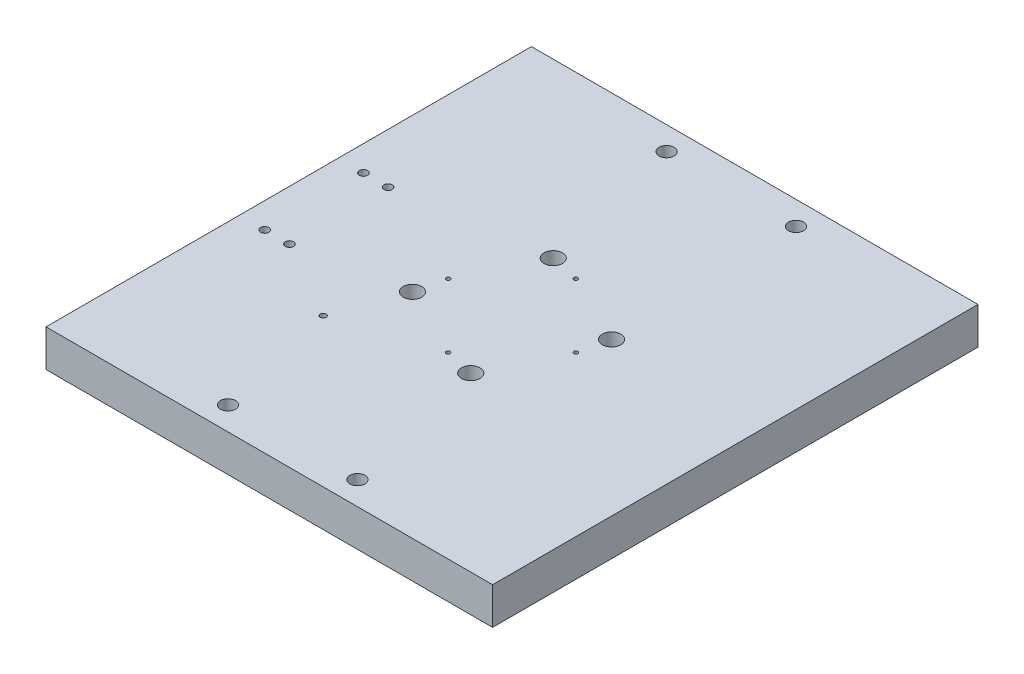
ISO-10303-21;
HEADER;
FILE_DESCRIPTION(('STEP AP214'),'2;1');
FILE_NAME('part.step','',(''),(''),'','','');
FILE_SCHEMA(('AUTOMOTIVE_DESIGN { 1 0 10303 214 1 1 1 1 }'));
ENDSEC;
DATA;
#1=APPLICATION_CONTEXT('core data for automotive mechanical design processes');
#2=APPLICATION_PROTOCOL_DEFINITION('international standard','automotive_design',2000,#1);
#3=PRODUCT_CONTEXT('',#1,'mechanical');
#4=PRODUCT('Part','Part','',(#3));
#5=PRODUCT_RELATED_PRODUCT_CATEGORY('part','',(#4));
#6=PRODUCT_DEFINITION_FORMATION('','',#4);
#7=PRODUCT_DEFINITION_CONTEXT('part definition',#1,'design');
#8=PRODUCT_DEFINITION('design','',#6,#7);
#9=PRODUCT_DEFINITION_SHAPE('','',#8);
#10=(LENGTH_UNIT() NAMED_UNIT(*) SI_UNIT(.MILLI.,.METRE.));
#11=(NAMED_UNIT(*) PLANE_ANGLE_UNIT() SI_UNIT($,.RADIAN.));
#12=(NAMED_UNIT(*) SI_UNIT($,.STERADIAN.) SOLID_ANGLE_UNIT());
#13=UNCERTAINTY_MEASURE_WITH_UNIT(LENGTH_MEASURE(1.E-05),#10,'distance_accuracy_value','');
#14=(GEOMETRIC_REPRESENTATION_CONTEXT(3) GLOBAL_UNCERTAINTY_ASSIGNED_CONTEXT((#13)) GLOBAL_UNIT_ASSIGNED_CONTEXT((#10,
#11,#12)) REPRESENTATION_CONTEXT('',''));
#15=CARTESIAN_POINT('',(0.,0.,0.));
#16=DIRECTION('',(0.,0.,1.));
#17=DIRECTION('',(1.,0.,0.));
#18=AXIS2_PLACEMENT_3D('',#15,#16,#17);
#19=CARTESIAN_POINT('',(72.511608988681,0.,-30.0352918726062));
#20=DIRECTION('',(0.,-1.,0.));
#21=DIRECTION('',(0.,0.,-1.));
#22=AXIS2_PLACEMENT_3D('',#19,#20,#21);
#23=CYLINDRICAL_SURFACE('',#22,9.52499999999999);
#24=CARTESIAN_POINT('',(72.511608988681,38.1,-30.0352918726062));
#25=DIRECTION('',(0.,-1.,0.));
#26=DIRECTION('',(0.,0.,-1.));
#27=AXIS2_PLACEMENT_3D('',#24,#25,#26);
#28=CIRCLE('',#27,9.52499999999999);
#29=CARTESIAN_POINT('',(72.511608988681,38.1,-39.5602918726062));
#30=VERTEX_POINT('',#29);
#31=EDGE_CURVE('E187',#30,#30,#28,.T.);
#32=ORIENTED_EDGE('',*,*,#31,.F.);
#33=EDGE_LOOP('',(#32));
#34=FACE_BOUND('',#33,.T.);
#35=CARTESIAN_POINT('',(72.511608988681,15.,-30.0352918726062));
#36=DIRECTION('',(0.,-1.,0.));
#37=DIRECTION('',(0.,0.,-1.));
#38=AXIS2_PLACEMENT_3D('',#35,#36,#37);
#39=CIRCLE('',#38,9.52499999999999);
#40=CARTESIAN_POINT('',(72.511608988681,15.,-39.5602918726062));
#41=VERTEX_POINT('',#40);
#42=EDGE_CURVE('E175',#41,#41,#39,.F.);
#43=ORIENTED_EDGE('',*,*,#42,.F.);
#44=EDGE_LOOP('',(#43));
#45=FACE_BOUND('',#44,.T.);
#46=ADVANCED_FACE('F35',(#34,#45),#23,.F.);
#47=CARTESIAN_POINT('',(-30.0352918726065,0.,-72.5116089886808));
#48=DIRECTION('',(0.,-1.,0.));
#49=DIRECTION('',(0.,0.,-1.));
#50=AXIS2_PLACEMENT_3D('',#47,#48,#49);
#51=CYLINDRICAL_SURFACE('',#50,9.52499999999999);
#52=CARTESIAN_POINT('',(-30.0352918726065,38.1,-72.5116089886808));
#53=DIRECTION('',(0.,-1.,0.));
#54=DIRECTION('',(0.,0.,-1.));
#55=AXIS2_PLACEMENT_3D('',#52,#53,#54);
#56=CIRCLE('',#55,9.52499999999999);
#57=CARTESIAN_POINT('',(-30.0352918726065,38.1,-82.0366089886808));
#58=VERTEX_POINT('',#57);
#59=EDGE_CURVE('E184',#58,#58,#56,.T.);
#60=ORIENTED_EDGE('',*,*,#59,.F.);
#61=EDGE_LOOP('',(#60));
#62=FACE_BOUND('',#61,.T.);
#63=CARTESIAN_POINT('',(-30.0352918726065,15.,-72.5116089886808));
#64=DIRECTION('',(0.,-1.,0.));
#65=DIRECTION('',(0.,0.,-1.));
#66=AXIS2_PLACEMENT_3D('',#63,#64,#65);
#67=CIRCLE('',#66,9.52499999999999);
#68=CARTESIAN_POINT('',(-30.0352918726065,15.,-82.0366089886808));
#69=VERTEX_POINT('',#68);
#70=EDGE_CURVE('E172',#69,#69,#67,.F.);
#71=ORIENTED_EDGE('',*,*,#70,.F.);
#72=EDGE_LOOP('',(#71));
#73=FACE_BOUND('',#72,.T.);
#74=ADVANCED_FACE('F253',(#62,#73),#51,.F.);
#75=CARTESIAN_POINT('',(30.0352918726065,0.,72.5116089886808));
#76=DIRECTION('',(0.,-1.,0.));
#77=DIRECTION('',(0.,0.,-1.));
#78=AXIS2_PLACEMENT_3D('',#75,#76,#77);
#79=CYLINDRICAL_SURFACE('',#78,9.52499999999999);
#80=CARTESIAN_POINT('',(30.0352918726065,38.1,72.5116089886808));
#81=DIRECTION('',(0.,-1.,0.));
#82=DIRECTION('',(0.,0.,-1.));
#83=AXIS2_PLACEMENT_3D('',#80,#81,#82);
#84=CIRCLE('',#83,9.52499999999999);
#85=CARTESIAN_POINT('',(30.0352918726065,38.1,62.9866089886808));
#86=VERTEX_POINT('',#85);
#87=EDGE_CURVE('E181',#86,#86,#84,.T.);
#88=ORIENTED_EDGE('',*,*,#87,.F.);
#89=EDGE_LOOP('',(#88));
#90=FACE_BOUND('',#89,.T.);
#91=CARTESIAN_POINT('',(30.0352918726065,15.,72.5116089886808));
#92=DIRECTION('',(0.,-1.,0.));
#93=DIRECTION('',(0.,0.,-1.));
#94=AXIS2_PLACEMENT_3D('',#91,#92,#93);
#95=CIRCLE('',#94,9.52499999999999);
#96=CARTESIAN_POINT('',(30.0352918726065,15.,62.9866089886808));
#97=VERTEX_POINT('',#96);
#98=EDGE_CURVE('E169',#97,#97,#95,.F.);
#99=ORIENTED_EDGE('',*,*,#98,.F.);
#100=EDGE_LOOP('',(#99));
#101=FACE_BOUND('',#100,.T.);
#102=ADVANCED_FACE('F259',(#90,#101),#79,.F.);
#103=CARTESIAN_POINT('',(-72.511608988681,0.,30.0352918726062));
#104=DIRECTION('',(0.,-1.,0.));
#105=DIRECTION('',(0.,0.,-1.));
#106=AXIS2_PLACEMENT_3D('',#103,#104,#105);
#107=CYLINDRICAL_SURFACE('',#106,9.52499999999999);
#108=CARTESIAN_POINT('',(-72.511608988681,38.1,30.0352918726062));
#109=DIRECTION('',(0.,-1.,0.));
#110=DIRECTION('',(0.,0.,-1.));
#111=AXIS2_PLACEMENT_3D('',#108,#109,#110);
#112=CIRCLE('',#111,9.52499999999999);
#113=CARTESIAN_POINT('',(-72.511608988681,38.1,20.5102918726062));
#114=VERTEX_POINT('',#113);
#115=EDGE_CURVE('E178',#114,#114,#112,.T.);
#116=ORIENTED_EDGE('',*,*,#115,.F.);
#117=EDGE_LOOP('',(#116));
#118=FACE_BOUND('',#117,.T.);
#119=CARTESIAN_POINT('',(-72.511608988681,15.,30.0352918726062));
#120=DIRECTION('',(0.,-1.,0.));
#121=DIRECTION('',(0.,0.,-1.));
#122=AXIS2_PLACEMENT_3D('',#119,#120,#121);
#123=CIRCLE('',#122,9.52499999999999);
#124=CARTESIAN_POINT('',(-72.511608988681,15.,20.5102918726062));
#125=VERTEX_POINT('',#124);
#126=EDGE_CURVE('E39',#125,#125,#123,.F.);
#127=ORIENTED_EDGE('',*,*,#126,.F.);
#128=EDGE_LOOP('',(#127));
#129=FACE_BOUND('',#128,.T.);
#130=ADVANCED_FACE('F336',(#118,#129),#107,.F.);
#131=CARTESIAN_POINT('',(230.,38.1,250.));
#132=DIRECTION('',(-1.,0.,0.));
#133=DIRECTION('',(0.,0.,1.));
#134=AXIS2_PLACEMENT_3D('',#131,#132,#133);
#135=PLANE('',#134);
#136=DIRECTION('',(0.,0.,-1.));
#137=VECTOR('',#136,1.);
#138=CARTESIAN_POINT('',(230.,0.,250.));
#139=LINE('',#138,#137);
#140=CARTESIAN_POINT('',(230.,0.,250.));
#141=VERTEX_POINT('',#140);
#142=CARTESIAN_POINT('',(230.,0.,-250.));
#143=VERTEX_POINT('',#142);
#144=EDGE_CURVE('E214',#141,#143,#139,.T.);
#145=ORIENTED_EDGE('',*,*,#144,.T.);
#146=DIRECTION('',(0.,-1.,0.));
#147=VECTOR('',#146,1.);
#148=CARTESIAN_POINT('',(230.,38.1,-250.));
#149=LINE('',#148,#147);
#150=CARTESIAN_POINT('',(230.,38.1,-250.));
#151=VERTEX_POINT('',#150);
#152=EDGE_CURVE('E11',#151,#143,#149,.T.);
#153=ORIENTED_EDGE('',*,*,#152,.F.);
#154=DIRECTION('',(0.,0.,-1.));
#155=VECTOR('',#154,1.);
#156=CARTESIAN_POINT('',(230.,38.1,250.));
#157=LINE('',#156,#155);
#158=CARTESIAN_POINT('',(230.,38.1,250.));
#159=VERTEX_POINT('',#158);
#160=EDGE_CURVE('E215',#159,#151,#157,.T.);
#161=ORIENTED_EDGE('',*,*,#160,.F.);
#162=DIRECTION('',(0.,-1.,0.));
#163=VECTOR('',#162,1.);
#164=CARTESIAN_POINT('',(230.,38.1,250.));
#165=LINE('',#164,#163);
#166=EDGE_CURVE('E221',#159,#141,#165,.T.);
#167=ORIENTED_EDGE('',*,*,#166,.T.);
#168=EDGE_LOOP('',(#145,#153,#161,#167));
#169=FACE_BOUND('',#168,.T.);
#170=ADVANCED_FACE('F37',(#169),#135,.F.);
#171=CARTESIAN_POINT('',(-230.,38.1,-250.));
#172=DIRECTION('',(0.,0.,1.));
#173=DIRECTION('',(1.,0.,0.));
#174=AXIS2_PLACEMENT_3D('',#171,#172,#173);
#175=PLANE('',#174);
#176=DIRECTION('',(-1.,0.,0.));
#177=VECTOR('',#176,1.);
#178=CARTESIAN_POINT('',(-230.,0.,-250.));
#179=LINE('',#178,#177);
#180=CARTESIAN_POINT('',(-230.,0.,-250.));
#181=VERTEX_POINT('',#180);
#182=EDGE_CURVE('E224',#143,#181,#179,.T.);
#183=ORIENTED_EDGE('',*,*,#182,.T.);
#184=DIRECTION('',(0.,-1.,0.));
#185=VECTOR('',#184,1.);
#186=CARTESIAN_POINT('',(-230.,38.1,-250.));
#187=LINE('',#186,#185);
#188=CARTESIAN_POINT('',(-230.,38.1,-250.));
#189=VERTEX_POINT('',#188);
#190=EDGE_CURVE('E45',#189,#181,#187,.T.);
#191=ORIENTED_EDGE('',*,*,#190,.F.);
#192=DIRECTION('',(-1.,0.,0.));
#193=VECTOR('',#192,1.);
#194=CARTESIAN_POINT('',(-230.,38.1,-250.));
#195=LINE('',#194,#193);
#196=EDGE_CURVE('E84',#151,#189,#195,.T.);
#197=ORIENTED_EDGE('',*,*,#196,.F.);
#198=ORIENTED_EDGE('',*,*,#152,.T.);
#199=EDGE_LOOP('',(#183,#191,#197,#198));
#200=FACE_BOUND('',#199,.T.);
#201=ADVANCED_FACE('F249',(#200),#175,.F.);
#202=CARTESIAN_POINT('',(-230.,38.1,250.));
#203=DIRECTION('',(1.,0.,0.));
#204=DIRECTION('',(0.,0.,-1.));
#205=AXIS2_PLACEMENT_3D('',#202,#203,#204);
#206=PLANE('',#205);
#207=DIRECTION('',(0.,0.,1.));
#208=VECTOR('',#207,1.);
#209=CARTESIAN_POINT('',(-230.,0.,250.));
#210=LINE('',#209,#208);
#211=CARTESIAN_POINT('',(-230.,0.,250.));
#212=VERTEX_POINT('',#211);
#213=EDGE_CURVE('E71',#181,#212,#210,.T.);
#214=ORIENTED_EDGE('',*,*,#213,.T.);
#215=DIRECTION('',(0.,-1.,0.));
#216=VECTOR('',#215,1.);
#217=CARTESIAN_POINT('',(-230.,38.1,250.));
#218=LINE('',#217,#216);
#219=CARTESIAN_POINT('',(-230.,38.1,250.));
#220=VERTEX_POINT('',#219);
#221=EDGE_CURVE('E229',#220,#212,#218,.T.);
#222=ORIENTED_EDGE('',*,*,#221,.F.);
#223=DIRECTION('',(0.,0.,1.));
#224=VECTOR('',#223,1.);
#225=CARTESIAN_POINT('',(-230.,38.1,250.));
#226=LINE('',#225,#224);
#227=EDGE_CURVE('E218',#189,#220,#226,.T.);
#228=ORIENTED_EDGE('',*,*,#227,.F.);
#229=ORIENTED_EDGE('',*,*,#190,.T.);
#230=EDGE_LOOP('',(#214,#222,#228,#229));
#231=FACE_BOUND('',#230,.T.);
#232=ADVANCED_FACE('F232',(#231),#206,.F.);
#233=CARTESIAN_POINT('',(-230.,38.1,250.));
#234=DIRECTION('',(0.,0.,-1.));
#235=DIRECTION('',(-1.,0.,0.));
#236=AXIS2_PLACEMENT_3D('',#233,#234,#235);
#237=PLANE('',#236);
#238=DIRECTION('',(1.,0.,0.));
#239=VECTOR('',#238,1.);
#240=CARTESIAN_POINT('',(-230.,0.,250.));
#241=LINE('',#240,#239);
#242=EDGE_CURVE('E77',#212,#141,#241,.T.);
#243=ORIENTED_EDGE('',*,*,#242,.T.);
#244=ORIENTED_EDGE('',*,*,#166,.F.);
#245=DIRECTION('',(1.,0.,0.));
#246=VECTOR('',#245,1.);
#247=CARTESIAN_POINT('',(-230.,38.1,250.));
#248=LINE('',#247,#246);
#249=EDGE_CURVE('E53',#220,#159,#248,.T.);
#250=ORIENTED_EDGE('',*,*,#249,.F.);
#251=ORIENTED_EDGE('',*,*,#221,.T.);
#252=EDGE_LOOP('',(#243,#244,#250,#251));
#253=FACE_BOUND('',#252,.T.);
#254=ADVANCED_FACE('F239',(#253),#237,.F.);
#255=CARTESIAN_POINT('',(0.,38.1,0.));
#256=DIRECTION('',(0.,-1.,0.));
#257=DIRECTION('',(0.,0.,-1.));
#258=AXIS2_PLACEMENT_3D('',#255,#256,#257);
#259=PLANE('',#258);
#260=CARTESIAN_POINT('',(-97.2271824131505,38.1,97.2271824131501));
#261=DIRECTION('',(0.,1.,0.));
#262=DIRECTION('',(0.,0.,1.));
#263=AXIS2_PLACEMENT_3D('',#260,#261,#262);
#264=CIRCLE('',#263,3.);
#265=CARTESIAN_POINT('',(-97.2271824131505,38.1,100.22718241315));
#266=VERTEX_POINT('',#265);
#267=EDGE_CURVE('E111',#266,#266,#264,.T.);
#268=ORIENTED_EDGE('',*,*,#267,.F.);
#269=EDGE_LOOP('',(#268));
#270=FACE_BOUND('',#269,.T.);
#271=CARTESIAN_POINT('',(-178.438,38.1,-50.7999999999997));
#272=DIRECTION('',(0.,-1.,0.));
#273=DIRECTION('',(0.,0.,-1.));
#274=AXIS2_PLACEMENT_3D('',#271,#272,#273);
#275=CIRCLE('',#274,4.25);
#276=CARTESIAN_POINT('',(-178.438,38.1,-55.0499999999997));
#277=VERTEX_POINT('',#276);
#278=EDGE_CURVE('E114',#277,#277,#275,.T.);
#279=ORIENTED_EDGE('',*,*,#278,.T.);
#280=EDGE_LOOP('',(#279));
#281=FACE_BOUND('',#280,.T.);
#282=CARTESIAN_POINT('',(-203.838,38.1,-50.7999999999997));
#283=DIRECTION('',(0.,-1.,0.));
#284=DIRECTION('',(0.,0.,-1.));
#285=AXIS2_PLACEMENT_3D('',#282,#283,#284);
#286=CIRCLE('',#285,4.25);
#287=CARTESIAN_POINT('',(-203.838,38.1,-55.0499999999997));
#288=VERTEX_POINT('',#287);
#289=EDGE_CURVE('E124',#288,#288,#286,.T.);
#290=ORIENTED_EDGE('',*,*,#289,.T.);
#291=EDGE_LOOP('',(#290));
#292=FACE_BOUND('',#291,.T.);
#293=CARTESIAN_POINT('',(-178.438130466165,38.1,50.8000000000007));
#294=DIRECTION('',(0.,-1.,0.));
#295=DIRECTION('',(0.,0.,-1.));
#296=AXIS2_PLACEMENT_3D('',#293,#294,#295);
#297=CIRCLE('',#296,4.25);
#298=CARTESIAN_POINT('',(-178.438130466165,38.1,46.5500000000007));
#299=VERTEX_POINT('',#298);
#300=EDGE_CURVE('E130',#299,#299,#297,.T.);
#301=ORIENTED_EDGE('',*,*,#300,.T.);
#302=EDGE_LOOP('',(#301));
#303=FACE_BOUND('',#302,.T.);
#304=CARTESIAN_POINT('',(-203.838,38.1,50.8814104658261));
#305=DIRECTION('',(0.,-1.,0.));
#306=DIRECTION('',(0.,0.,-1.));
#307=AXIS2_PLACEMENT_3D('',#304,#305,#306);
#308=CIRCLE('',#307,4.25);
#309=CARTESIAN_POINT('',(-203.838,38.1,46.6314104658261));
#310=VERTEX_POINT('',#309);
#311=EDGE_CURVE('E136',#310,#310,#308,.T.);
#312=ORIENTED_EDGE('',*,*,#311,.T.);
#313=EDGE_LOOP('',(#312));
#314=FACE_BOUND('',#313,.T.);
#315=CARTESIAN_POINT('',(66.6700000000001,38.1,225.87));
#316=DIRECTION('',(0.,1.,0.));
#317=DIRECTION('',(0.,0.,1.));
#318=AXIS2_PLACEMENT_3D('',#315,#316,#317);
#319=CIRCLE('',#318,7.74999999999999);
#320=CARTESIAN_POINT('',(66.6700000000001,38.1,233.62));
#321=VERTEX_POINT('',#320);
#322=EDGE_CURVE('E139',#321,#321,#319,.T.);
#323=ORIENTED_EDGE('',*,*,#322,.F.);
#324=EDGE_LOOP('',(#323));
#325=FACE_BOUND('',#324,.T.);
#326=CARTESIAN_POINT('',(-66.6699999999999,38.1,225.87));
#327=DIRECTION('',(0.,1.,0.));
#328=DIRECTION('',(0.,0.,1.));
#329=AXIS2_PLACEMENT_3D('',#326,#327,#328);
#330=CIRCLE('',#329,7.74999999999999);
#331=CARTESIAN_POINT('',(-66.6699999999999,38.1,233.62));
#332=VERTEX_POINT('',#331);
#333=EDGE_CURVE('E145',#332,#332,#330,.T.);
#334=ORIENTED_EDGE('',*,*,#333,.F.);
#335=EDGE_LOOP('',(#334));
#336=FACE_BOUND('',#335,.T.);
#337=CARTESIAN_POINT('',(-66.67,38.1,-225.87));
#338=DIRECTION('',(0.,1.,0.));
#339=DIRECTION('',(0.,0.,1.));
#340=AXIS2_PLACEMENT_3D('',#337,#338,#339);
#341=CIRCLE('',#340,7.74999999999999);
#342=CARTESIAN_POINT('',(-66.67,38.1,-218.12));
#343=VERTEX_POINT('',#342);
#344=EDGE_CURVE('E151',#343,#343,#341,.T.);
#345=ORIENTED_EDGE('',*,*,#344,.F.);
#346=EDGE_LOOP('',(#345));
#347=FACE_BOUND('',#346,.T.);
#348=CARTESIAN_POINT('',(66.67,38.1,-225.87));
#349=DIRECTION('',(0.,1.,0.));
#350=DIRECTION('',(0.,0.,1.));
#351=AXIS2_PLACEMENT_3D('',#348,#349,#350);
#352=CIRCLE('',#351,7.74999999999999);
#353=CARTESIAN_POINT('',(66.67,38.1,-218.12));
#354=VERTEX_POINT('',#353);
#355=EDGE_CURVE('E157',#354,#354,#352,.T.);
#356=ORIENTED_EDGE('',*,*,#355,.F.);
#357=EDGE_LOOP('',(#356));
#358=FACE_BOUND('',#357,.T.);
#359=ORIENTED_EDGE('',*,*,#115,.T.);
#360=EDGE_LOOP('',(#359));
#361=FACE_BOUND('',#360,.T.);
#362=ORIENTED_EDGE('',*,*,#87,.T.);
#363=EDGE_LOOP('',(#362));
#364=FACE_BOUND('',#363,.T.);
#365=ORIENTED_EDGE('',*,*,#59,.T.);
#366=EDGE_LOOP('',(#365));
#367=FACE_BOUND('',#366,.T.);
#368=ORIENTED_EDGE('',*,*,#31,.T.);
#369=EDGE_LOOP('',(#368));
#370=FACE_BOUND('',#369,.T.);
#371=CARTESIAN_POINT('',(0.,38.1,-65.786));
#372=DIRECTION('',(0.,1.,0.));
#373=DIRECTION('',(0.,0.,1.));
#374=AXIS2_PLACEMENT_3D('',#371,#372,#373);
#375=CIRCLE('',#374,2.1);
#376=CARTESIAN_POINT('',(0.,38.1,-63.686));
#377=VERTEX_POINT('',#376);
#378=EDGE_CURVE('E190',#377,#377,#375,.T.);
#379=ORIENTED_EDGE('',*,*,#378,.F.);
#380=EDGE_LOOP('',(#379));
#381=FACE_BOUND('',#380,.T.);
#382=CARTESIAN_POINT('',(65.786,38.1,0.));
#383=DIRECTION('',(0.,1.,0.));
#384=DIRECTION('',(0.,0.,1.));
#385=AXIS2_PLACEMENT_3D('',#382,#383,#384);
#386=CIRCLE('',#385,2.1);
#387=CARTESIAN_POINT('',(65.786,38.1,2.10000000000002));
#388=VERTEX_POINT('',#387);
#389=EDGE_CURVE('E196',#388,#388,#386,.T.);
#390=ORIENTED_EDGE('',*,*,#389,.F.);
#391=EDGE_LOOP('',(#390));
#392=FACE_BOUND('',#391,.T.);
#393=CARTESIAN_POINT('',(0.,38.1,65.786));
#394=DIRECTION('',(0.,1.,0.));
#395=DIRECTION('',(0.,0.,1.));
#396=AXIS2_PLACEMENT_3D('',#393,#394,#395);
#397=CIRCLE('',#396,2.1);
#398=CARTESIAN_POINT('',(0.,38.1,67.886));
#399=VERTEX_POINT('',#398);
#400=EDGE_CURVE('E202',#399,#399,#397,.T.);
#401=ORIENTED_EDGE('',*,*,#400,.F.);
#402=EDGE_LOOP('',(#401));
#403=FACE_BOUND('',#402,.T.);
#404=CARTESIAN_POINT('',(-65.786,38.1,0.));
#405=DIRECTION('',(0.,1.,0.));
#406=DIRECTION('',(0.,0.,1.));
#407=AXIS2_PLACEMENT_3D('',#404,#405,#406);
#408=CIRCLE('',#407,2.1);
#409=CARTESIAN_POINT('',(-65.786,38.1,2.10000000000002));
#410=VERTEX_POINT('',#409);
#411=EDGE_CURVE('E208',#410,#410,#408,.T.);
#412=ORIENTED_EDGE('',*,*,#411,.F.);
#413=EDGE_LOOP('',(#412));
#414=FACE_BOUND('',#413,.T.);
#415=ORIENTED_EDGE('',*,*,#160,.T.);
#416=ORIENTED_EDGE('',*,*,#196,.T.);
#417=ORIENTED_EDGE('',*,*,#227,.T.);
#418=ORIENTED_EDGE('',*,*,#249,.T.);
#419=EDGE_LOOP('',(#415,#416,#417,#418));
#420=FACE_BOUND('',#419,.T.);
#421=ADVANCED_FACE('F241',(#270,#281,#292,#303,#314,#325,#336,#347,#358,#361,#364,#367,#370,
#381,#392,#403,#414,#420),#259,.F.);
#422=CARTESIAN_POINT('',(0.,0.,0.));
#423=DIRECTION('',(0.,-1.,0.));
#424=DIRECTION('',(0.,0.,-1.));
#425=AXIS2_PLACEMENT_3D('',#422,#423,#424);
#426=PLANE('',#425);
#427=CARTESIAN_POINT('',(-178.438,0.,-50.7999999999997));
#428=DIRECTION('',(0.,-1.,0.));
#429=DIRECTION('',(0.,0.,-1.));
#430=AXIS2_PLACEMENT_3D('',#427,#428,#429);
#431=CIRCLE('',#430,4.24999999999998);
#432=CARTESIAN_POINT('',(-178.438,0.,-55.0499999999997));
#433=VERTEX_POINT('',#432);
#434=EDGE_CURVE('E110',#433,#433,#431,.T.);
#435=ORIENTED_EDGE('',*,*,#434,.F.);
#436=EDGE_LOOP('',(#435));
#437=FACE_BOUND('',#436,.T.);
#438=CARTESIAN_POINT('',(-203.838,0.,-50.7999999999997));
#439=DIRECTION('',(0.,-1.,0.));
#440=DIRECTION('',(0.,0.,-1.));
#441=AXIS2_PLACEMENT_3D('',#438,#439,#440);
#442=CIRCLE('',#441,4.24999999999998);
#443=CARTESIAN_POINT('',(-203.838,0.,-55.0499999999997));
#444=VERTEX_POINT('',#443);
#445=EDGE_CURVE('E121',#444,#444,#442,.T.);
#446=ORIENTED_EDGE('',*,*,#445,.F.);
#447=EDGE_LOOP('',(#446));
#448=FACE_BOUND('',#447,.T.);
#449=CARTESIAN_POINT('',(-178.438130466165,0.,50.8000000000007));
#450=DIRECTION('',(0.,-1.,0.));
#451=DIRECTION('',(0.,0.,-1.));
#452=AXIS2_PLACEMENT_3D('',#449,#450,#451);
#453=CIRCLE('',#452,4.24999999999998);
#454=CARTESIAN_POINT('',(-178.438130466165,0.,46.5500000000007));
#455=VERTEX_POINT('',#454);
#456=EDGE_CURVE('E127',#455,#455,#453,.T.);
#457=ORIENTED_EDGE('',*,*,#456,.F.);
#458=EDGE_LOOP('',(#457));
#459=FACE_BOUND('',#458,.T.);
#460=CARTESIAN_POINT('',(-203.838,0.,50.8814104658261));
#461=DIRECTION('',(0.,-1.,0.));
#462=DIRECTION('',(0.,0.,-1.));
#463=AXIS2_PLACEMENT_3D('',#460,#461,#462);
#464=CIRCLE('',#463,4.24999999999998);
#465=CARTESIAN_POINT('',(-203.838,0.,46.6314104658262));
#466=VERTEX_POINT('',#465);
#467=EDGE_CURVE('E133',#466,#466,#464,.T.);
#468=ORIENTED_EDGE('',*,*,#467,.F.);
#469=EDGE_LOOP('',(#468));
#470=FACE_BOUND('',#469,.T.);
#471=CARTESIAN_POINT('',(66.6700000000001,0.,225.87));
#472=DIRECTION('',(0.,1.,0.));
#473=DIRECTION('',(0.,0.,1.));
#474=AXIS2_PLACEMENT_3D('',#471,#472,#473);
#475=CIRCLE('',#474,7.74999999999999);
#476=CARTESIAN_POINT('',(66.6700000000001,0.,233.62));
#477=VERTEX_POINT('',#476);
#478=EDGE_CURVE('E142',#477,#477,#475,.T.);
#479=ORIENTED_EDGE('',*,*,#478,.T.);
#480=EDGE_LOOP('',(#479));
#481=FACE_BOUND('',#480,.T.);
#482=CARTESIAN_POINT('',(-66.6699999999999,0.,225.87));
#483=DIRECTION('',(0.,1.,0.));
#484=DIRECTION('',(0.,0.,1.));
#485=AXIS2_PLACEMENT_3D('',#482,#483,#484);
#486=CIRCLE('',#485,7.74999999999999);
#487=CARTESIAN_POINT('',(-66.6699999999999,0.,233.62));
#488=VERTEX_POINT('',#487);
#489=EDGE_CURVE('E148',#488,#488,#486,.T.);
#490=ORIENTED_EDGE('',*,*,#489,.T.);
#491=EDGE_LOOP('',(#490));
#492=FACE_BOUND('',#491,.T.);
#493=CARTESIAN_POINT('',(-66.67,0.,-225.87));
#494=DIRECTION('',(0.,1.,0.));
#495=DIRECTION('',(0.,0.,1.));
#496=AXIS2_PLACEMENT_3D('',#493,#494,#495);
#497=CIRCLE('',#496,7.74999999999999);
#498=CARTESIAN_POINT('',(-66.67,0.,-218.12));
#499=VERTEX_POINT('',#498);
#500=EDGE_CURVE('E154',#499,#499,#497,.T.);
#501=ORIENTED_EDGE('',*,*,#500,.T.);
#502=EDGE_LOOP('',(#501));
#503=FACE_BOUND('',#502,.T.);
#504=CARTESIAN_POINT('',(66.67,0.,-225.87));
#505=DIRECTION('',(0.,1.,0.));
#506=DIRECTION('',(0.,0.,1.));
#507=AXIS2_PLACEMENT_3D('',#504,#505,#506);
#508=CIRCLE('',#507,7.74999999999999);
#509=CARTESIAN_POINT('',(66.67,0.,-218.12));
#510=VERTEX_POINT('',#509);
#511=EDGE_CURVE('E160',#510,#510,#508,.T.);
#512=ORIENTED_EDGE('',*,*,#511,.T.);
#513=EDGE_LOOP('',(#512));
#514=FACE_BOUND('',#513,.T.);
#515=CARTESIAN_POINT('',(0.,0.,0.));
#516=DIRECTION('',(0.,-1.,0.));
#517=DIRECTION('',(0.,0.,-1.));
#518=AXIS2_PLACEMENT_3D('',#515,#516,#517);
#519=CIRCLE('',#518,90.);
#520=CARTESIAN_POINT('',(0.,0.,-90.));
#521=VERTEX_POINT('',#520);
#522=EDGE_CURVE('E163',#521,#521,#519,.T.);
#523=ORIENTED_EDGE('',*,*,#522,.F.);
#524=EDGE_LOOP('',(#523));
#525=FACE_BOUND('',#524,.T.);
#526=ORIENTED_EDGE('',*,*,#144,.F.);
#527=ORIENTED_EDGE('',*,*,#242,.F.);
#528=ORIENTED_EDGE('',*,*,#213,.F.);
#529=ORIENTED_EDGE('',*,*,#182,.F.);
#530=EDGE_LOOP('',(#526,#527,#528,#529));
#531=FACE_BOUND('',#530,.T.);
#532=ADVANCED_FACE('F235',(#437,#448,#459,#470,#481,#492,#503,#514,#525,#531),#426,.T.);
#533=CARTESIAN_POINT('',(-65.786,18.1,0.));
#534=DIRECTION('',(0.,1.,0.));
#535=DIRECTION('',(0.,0.,1.));
#536=AXIS2_PLACEMENT_3D('',#533,#534,#535);
#537=CONICAL_SURFACE('',#536,2.09999999999999,1.02974425867665);
#538=CARTESIAN_POINT('',(-65.786,16.8381927000421,0.));
#539=VERTEX_POINT('',#538);
#540=VERTEX_LOOP('',#539);
#541=FACE_BOUND('',#540,.T.);
#542=CARTESIAN_POINT('',(-65.786,18.1,0.));
#543=DIRECTION('',(0.,1.,0.));
#544=DIRECTION('',(0.,0.,1.));
#545=AXIS2_PLACEMENT_3D('',#542,#543,#544);
#546=CIRCLE('',#545,2.09999999999999);
#547=CARTESIAN_POINT('',(-65.786,18.1,2.10000000000001));
#548=VERTEX_POINT('',#547);
#549=EDGE_CURVE('E211',#548,#548,#546,.T.);
#550=ORIENTED_EDGE('',*,*,#549,.T.);
#551=EDGE_LOOP('',(#550));
#552=FACE_BOUND('',#551,.T.);
#553=ADVANCED_FACE('F294',(#541,#552),#537,.F.);
#554=CARTESIAN_POINT('',(-65.786,38.1,0.));
#555=DIRECTION('',(0.,1.,0.));
#556=DIRECTION('',(0.,0.,1.));
#557=AXIS2_PLACEMENT_3D('',#554,#555,#556);
#558=CYLINDRICAL_SURFACE('',#557,2.1);
#559=ORIENTED_EDGE('',*,*,#549,.F.);
#560=EDGE_LOOP('',(#559));
#561=FACE_BOUND('',#560,.T.);
#562=ORIENTED_EDGE('',*,*,#411,.T.);
#563=EDGE_LOOP('',(#562));
#564=FACE_BOUND('',#563,.T.);
#565=ADVANCED_FACE('F290',(#561,#564),#558,.F.);
#566=CARTESIAN_POINT('',(0.,18.1,65.786));
#567=DIRECTION('',(0.,1.,0.));
#568=DIRECTION('',(0.,0.,1.));
#569=AXIS2_PLACEMENT_3D('',#566,#567,#568);
#570=CONICAL_SURFACE('',#569,2.1,1.02974425867665);
#571=CARTESIAN_POINT('',(0.,16.8381927000421,65.786));
#572=VERTEX_POINT('',#571);
#573=VERTEX_LOOP('',#572);
#574=FACE_BOUND('',#573,.T.);
#575=CARTESIAN_POINT('',(0.,18.1,65.786));
#576=DIRECTION('',(0.,1.,0.));
#577=DIRECTION('',(0.,0.,1.));
#578=AXIS2_PLACEMENT_3D('',#575,#576,#577);
#579=CIRCLE('',#578,2.1);
#580=CARTESIAN_POINT('',(0.,18.1,67.886));
#581=VERTEX_POINT('',#580);
#582=EDGE_CURVE('E205',#581,#581,#579,.T.);
#583=ORIENTED_EDGE('',*,*,#582,.T.);
#584=EDGE_LOOP('',(#583));
#585=FACE_BOUND('',#584,.T.);
#586=ADVANCED_FACE('F286',(#574,#585),#570,.F.);
#587=CARTESIAN_POINT('',(0.,38.1,65.786));
#588=DIRECTION('',(0.,1.,0.));
#589=DIRECTION('',(0.,0.,1.));
#590=AXIS2_PLACEMENT_3D('',#587,#588,#589);
#591=CYLINDRICAL_SURFACE('',#590,2.1);
#592=ORIENTED_EDGE('',*,*,#582,.F.);
#593=EDGE_LOOP('',(#592));
#594=FACE_BOUND('',#593,.T.);
#595=ORIENTED_EDGE('',*,*,#400,.T.);
#596=EDGE_LOOP('',(#595));
#597=FACE_BOUND('',#596,.T.);
#598=ADVANCED_FACE('F282',(#594,#597),#591,.F.);
#599=CARTESIAN_POINT('',(65.786,18.1,0.));
#600=DIRECTION('',(0.,1.,0.));
#601=DIRECTION('',(0.,0.,1.));
#602=AXIS2_PLACEMENT_3D('',#599,#600,#601);
#603=CONICAL_SURFACE('',#602,2.09999999999999,1.02974425867665);
#604=CARTESIAN_POINT('',(65.786,16.8381927000421,0.));
#605=VERTEX_POINT('',#604);
#606=VERTEX_LOOP('',#605);
#607=FACE_BOUND('',#606,.T.);
#608=CARTESIAN_POINT('',(65.786,18.1,0.));
#609=DIRECTION('',(0.,1.,0.));
#610=DIRECTION('',(0.,0.,1.));
#611=AXIS2_PLACEMENT_3D('',#608,#609,#610);
#612=CIRCLE('',#611,2.09999999999999);
#613=CARTESIAN_POINT('',(65.786,18.1,2.10000000000001));
#614=VERTEX_POINT('',#613);
#615=EDGE_CURVE('E199',#614,#614,#612,.T.);
#616=ORIENTED_EDGE('',*,*,#615,.T.);
#617=EDGE_LOOP('',(#616));
#618=FACE_BOUND('',#617,.T.);
#619=ADVANCED_FACE('F278',(#607,#618),#603,.F.);
#620=CARTESIAN_POINT('',(65.786,38.1,0.));
#621=DIRECTION('',(0.,1.,0.));
#622=DIRECTION('',(0.,0.,1.));
#623=AXIS2_PLACEMENT_3D('',#620,#621,#622);
#624=CYLINDRICAL_SURFACE('',#623,2.1);
#625=ORIENTED_EDGE('',*,*,#615,.F.);
#626=EDGE_LOOP('',(#625));
#627=FACE_BOUND('',#626,.T.);
#628=ORIENTED_EDGE('',*,*,#389,.T.);
#629=EDGE_LOOP('',(#628));
#630=FACE_BOUND('',#629,.T.);
#631=ADVANCED_FACE('F274',(#627,#630),#624,.F.);
#632=CARTESIAN_POINT('',(0.,18.1,-65.786));
#633=DIRECTION('',(0.,1.,0.));
#634=DIRECTION('',(0.,0.,1.));
#635=AXIS2_PLACEMENT_3D('',#632,#633,#634);
#636=CONICAL_SURFACE('',#635,2.1,1.02974425867665);
#637=CARTESIAN_POINT('',(0.,16.8381927000421,-65.786));
#638=VERTEX_POINT('',#637);
#639=VERTEX_LOOP('',#638);
#640=FACE_BOUND('',#639,.T.);
#641=CARTESIAN_POINT('',(0.,18.1,-65.786));
#642=DIRECTION('',(0.,1.,0.));
#643=DIRECTION('',(0.,0.,1.));
#644=AXIS2_PLACEMENT_3D('',#641,#642,#643);
#645=CIRCLE('',#644,2.1);
#646=CARTESIAN_POINT('',(0.,18.1,-63.686));
#647=VERTEX_POINT('',#646);
#648=EDGE_CURVE('E193',#647,#647,#645,.T.);
#649=ORIENTED_EDGE('',*,*,#648,.T.);
#650=EDGE_LOOP('',(#649));
#651=FACE_BOUND('',#650,.T.);
#652=ADVANCED_FACE('F270',(#640,#651),#636,.F.);
#653=CARTESIAN_POINT('',(0.,38.1,-65.786));
#654=DIRECTION('',(0.,1.,0.));
#655=DIRECTION('',(0.,0.,1.));
#656=AXIS2_PLACEMENT_3D('',#653,#654,#655);
#657=CYLINDRICAL_SURFACE('',#656,2.1);
#658=ORIENTED_EDGE('',*,*,#648,.F.);
#659=EDGE_LOOP('',(#658));
#660=FACE_BOUND('',#659,.T.);
#661=ORIENTED_EDGE('',*,*,#378,.T.);
#662=EDGE_LOOP('',(#661));
#663=FACE_BOUND('',#662,.T.);
#664=ADVANCED_FACE('F266',(#660,#663),#657,.F.);
#665=CARTESIAN_POINT('',(0.,15.,0.));
#666=DIRECTION('',(0.,-1.,0.));
#667=DIRECTION('',(0.,0.,-1.));
#668=AXIS2_PLACEMENT_3D('',#665,#666,#667);
#669=PLANE('',#668);
#670=ORIENTED_EDGE('',*,*,#70,.T.);
#671=EDGE_LOOP('',(#670));
#672=FACE_BOUND('',#671,.T.);
#673=ORIENTED_EDGE('',*,*,#126,.T.);
#674=EDGE_LOOP('',(#673));
#675=FACE_BOUND('',#674,.T.);
#676=CARTESIAN_POINT('',(0.,15.,0.));
#677=DIRECTION('',(0.,-1.,0.));
#678=DIRECTION('',(0.,0.,-1.));
#679=AXIS2_PLACEMENT_3D('',#676,#677,#678);
#680=CIRCLE('',#679,90.);
#681=CARTESIAN_POINT('',(0.,15.,-90.));
#682=VERTEX_POINT('',#681);
#683=EDGE_CURVE('E164',#682,#682,#680,.T.);
#684=ORIENTED_EDGE('',*,*,#683,.T.);
#685=EDGE_LOOP('',(#684));
#686=FACE_BOUND('',#685,.T.);
#687=ORIENTED_EDGE('',*,*,#98,.T.);
#688=EDGE_LOOP('',(#687));
#689=FACE_BOUND('',#688,.T.);
#690=ORIENTED_EDGE('',*,*,#42,.T.);
#691=EDGE_LOOP('',(#690));
#692=FACE_BOUND('',#691,.T.);
#693=ADVANCED_FACE('F269',(#672,#675,#686,#689,#692),#669,.T.);
#694=CARTESIAN_POINT('',(0.,15.,0.));
#695=DIRECTION('',(0.,-1.,0.));
#696=DIRECTION('',(0.,0.,-1.));
#697=AXIS2_PLACEMENT_3D('',#694,#695,#696);
#698=CYLINDRICAL_SURFACE('',#697,90.);
#699=ORIENTED_EDGE('',*,*,#683,.F.);
#700=EDGE_LOOP('',(#699));
#701=FACE_BOUND('',#700,.T.);
#702=ORIENTED_EDGE('',*,*,#522,.T.);
#703=EDGE_LOOP('',(#702));
#704=FACE_BOUND('',#703,.T.);
#705=ADVANCED_FACE('F320',(#701,#704),#698,.F.);
#706=CARTESIAN_POINT('',(66.67,38.1,-225.87));
#707=DIRECTION('',(0.,1.,0.));
#708=DIRECTION('',(0.,0.,1.));
#709=AXIS2_PLACEMENT_3D('',#706,#707,#708);
#710=CYLINDRICAL_SURFACE('',#709,7.74999999999999);
#711=ORIENTED_EDGE('',*,*,#511,.F.);
#712=EDGE_LOOP('',(#711));
#713=FACE_BOUND('',#712,.T.);
#714=ORIENTED_EDGE('',*,*,#355,.T.);
#715=EDGE_LOOP('',(#714));
#716=FACE_BOUND('',#715,.T.);
#717=ADVANCED_FACE('F322',(#713,#716),#710,.F.);
#718=CARTESIAN_POINT('',(-66.67,38.1,-225.87));
#719=DIRECTION('',(0.,1.,0.));
#720=DIRECTION('',(0.,0.,1.));
#721=AXIS2_PLACEMENT_3D('',#718,#719,#720);
#722=CYLINDRICAL_SURFACE('',#721,7.74999999999999);
#723=ORIENTED_EDGE('',*,*,#500,.F.);
#724=EDGE_LOOP('',(#723));
#725=FACE_BOUND('',#724,.T.);
#726=ORIENTED_EDGE('',*,*,#344,.T.);
#727=EDGE_LOOP('',(#726));
#728=FACE_BOUND('',#727,.T.);
#729=ADVANCED_FACE('F329',(#725,#728),#722,.F.);
#730=CARTESIAN_POINT('',(-66.6699999999999,38.1,225.87));
#731=DIRECTION('',(0.,1.,0.));
#732=DIRECTION('',(0.,0.,1.));
#733=AXIS2_PLACEMENT_3D('',#730,#731,#732);
#734=CYLINDRICAL_SURFACE('',#733,7.74999999999999);
#735=ORIENTED_EDGE('',*,*,#489,.F.);
#736=EDGE_LOOP('',(#735));
#737=FACE_BOUND('',#736,.T.);
#738=ORIENTED_EDGE('',*,*,#333,.T.);
#739=EDGE_LOOP('',(#738));
#740=FACE_BOUND('',#739,.T.);
#741=ADVANCED_FACE('F482',(#737,#740),#734,.F.);
#742=CARTESIAN_POINT('',(66.6700000000001,38.1,225.87));
#743=DIRECTION('',(0.,1.,0.));
#744=DIRECTION('',(0.,0.,1.));
#745=AXIS2_PLACEMENT_3D('',#742,#743,#744);
#746=CYLINDRICAL_SURFACE('',#745,7.74999999999999);
#747=ORIENTED_EDGE('',*,*,#478,.F.);
#748=EDGE_LOOP('',(#747));
#749=FACE_BOUND('',#748,.T.);
#750=ORIENTED_EDGE('',*,*,#322,.T.);
#751=EDGE_LOOP('',(#750));
#752=FACE_BOUND('',#751,.T.);
#753=ADVANCED_FACE('F491',(#749,#752),#746,.F.);
#754=CARTESIAN_POINT('',(-203.838,0.,50.8814104658261));
#755=DIRECTION('',(0.,-1.,0.));
#756=DIRECTION('',(0.,0.,-1.));
#757=AXIS2_PLACEMENT_3D('',#754,#755,#756);
#758=CYLINDRICAL_SURFACE('',#757,4.24999999999999);
#759=ORIENTED_EDGE('',*,*,#311,.F.);
#760=EDGE_LOOP('',(#759));
#761=FACE_BOUND('',#760,.T.);
#762=ORIENTED_EDGE('',*,*,#467,.T.);
#763=EDGE_LOOP('',(#762));
#764=FACE_BOUND('',#763,.T.);
#765=ADVANCED_FACE('F500',(#761,#764),#758,.F.);
#766=CARTESIAN_POINT('',(-178.438130466165,0.,50.8000000000007));
#767=DIRECTION('',(0.,-1.,0.));
#768=DIRECTION('',(0.,0.,-1.));
#769=AXIS2_PLACEMENT_3D('',#766,#767,#768);
#770=CYLINDRICAL_SURFACE('',#769,4.24999999999999);
#771=ORIENTED_EDGE('',*,*,#300,.F.);
#772=EDGE_LOOP('',(#771));
#773=FACE_BOUND('',#772,.T.);
#774=ORIENTED_EDGE('',*,*,#456,.T.);
#775=EDGE_LOOP('',(#774));
#776=FACE_BOUND('',#775,.T.);
#777=ADVANCED_FACE('F509',(#773,#776),#770,.F.);
#778=CARTESIAN_POINT('',(-203.838,0.,-50.7999999999997));
#779=DIRECTION('',(0.,-1.,0.));
#780=DIRECTION('',(0.,0.,-1.));
#781=AXIS2_PLACEMENT_3D('',#778,#779,#780);
#782=CYLINDRICAL_SURFACE('',#781,4.24999999999999);
#783=ORIENTED_EDGE('',*,*,#289,.F.);
#784=EDGE_LOOP('',(#783));
#785=FACE_BOUND('',#784,.T.);
#786=ORIENTED_EDGE('',*,*,#445,.T.);
#787=EDGE_LOOP('',(#786));
#788=FACE_BOUND('',#787,.T.);
#789=ADVANCED_FACE('F518',(#785,#788),#782,.F.);
#790=CARTESIAN_POINT('',(-178.438,0.,-50.7999999999997));
#791=DIRECTION('',(0.,-1.,0.));
#792=DIRECTION('',(0.,0.,-1.));
#793=AXIS2_PLACEMENT_3D('',#790,#791,#792);
#794=CYLINDRICAL_SURFACE('',#793,4.24999999999999);
#795=ORIENTED_EDGE('',*,*,#278,.F.);
#796=EDGE_LOOP('',(#795));
#797=FACE_BOUND('',#796,.T.);
#798=ORIENTED_EDGE('',*,*,#434,.T.);
#799=EDGE_LOOP('',(#798));
#800=FACE_BOUND('',#799,.T.);
#801=ADVANCED_FACE('F104',(#797,#800),#794,.F.);
#802=CARTESIAN_POINT('',(-97.2271824131505,28.1,97.2271824131501));
#803=DIRECTION('',(0.,1.,0.));
#804=DIRECTION('',(0.,0.,1.));
#805=AXIS2_PLACEMENT_3D('',#802,#803,#804);
#806=CONICAL_SURFACE('',#805,3.,1.02974425867666);
#807=CARTESIAN_POINT('',(-97.2271824131505,26.2974181429173,97.2271824131501));
#808=VERTEX_POINT('',#807);
#809=VERTEX_LOOP('',#808);
#810=FACE_BOUND('',#809,.T.);
#811=CARTESIAN_POINT('',(-97.2271824131505,28.1,97.2271824131501));
#812=DIRECTION('',(0.,1.,0.));
#813=DIRECTION('',(0.,0.,1.));
#814=AXIS2_PLACEMENT_3D('',#811,#812,#813);
#815=CIRCLE('',#814,3.);
#816=CARTESIAN_POINT('',(-97.2271824131505,28.1,100.22718241315));
#817=VERTEX_POINT('',#816);
#818=EDGE_CURVE('E108',#817,#817,#815,.T.);
#819=ORIENTED_EDGE('',*,*,#818,.T.);
#820=EDGE_LOOP('',(#819));
#821=FACE_BOUND('',#820,.T.);
#822=ADVANCED_FACE('F100',(#810,#821),#806,.F.);
#823=CARTESIAN_POINT('',(-97.2271824131505,38.1,97.2271824131501));
#824=DIRECTION('',(0.,1.,0.));
#825=DIRECTION('',(0.,0.,1.));
#826=AXIS2_PLACEMENT_3D('',#823,#824,#825);
#827=CYLINDRICAL_SURFACE('',#826,3.);
#828=ORIENTED_EDGE('',*,*,#818,.F.);
#829=EDGE_LOOP('',(#828));
#830=FACE_BOUND('',#829,.T.);
#831=ORIENTED_EDGE('',*,*,#267,.T.);
#832=EDGE_LOOP('',(#831));
#833=FACE_BOUND('',#832,.T.);
#834=ADVANCED_FACE('F103',(#830,#833),#827,.F.);
#835=CLOSED_SHELL('',(#46,#74,#102,#130,#170,#201,#232,#254,#421,#532,#553,#565,#586,#598,#619,
#631,#652,#664,#693,#705,#717,#729,#741,#753,#765,#777,#789,#801,#822,#834));
#836=MANIFOLD_SOLID_BREP('B2',#835);
#837=ADVANCED_BREP_SHAPE_REPRESENTATION('',(#18,#836),#14);
#838=SHAPE_DEFINITION_REPRESENTATION(#9,#837);
ENDSEC;
END-ISO-10303-21;
